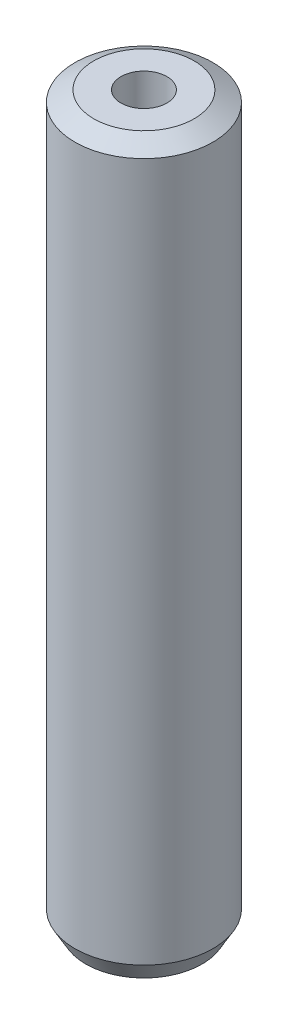
ISO-10303-21;
HEADER;
FILE_DESCRIPTION(('STEP AP214'),'2;1');
FILE_NAME('part.step','',(''),(''),'','','');
FILE_SCHEMA(('AUTOMOTIVE_DESIGN { 1 0 10303 214 1 1 1 1 }'));
ENDSEC;
DATA;
#1=APPLICATION_CONTEXT('core data for automotive mechanical design processes');
#2=APPLICATION_PROTOCOL_DEFINITION('international standard','automotive_design',2000,#1);
#3=PRODUCT_CONTEXT('',#1,'mechanical');
#4=PRODUCT('Part','Part','',(#3));
#5=PRODUCT_RELATED_PRODUCT_CATEGORY('part','',(#4));
#6=PRODUCT_DEFINITION_FORMATION('','',#4);
#7=PRODUCT_DEFINITION_CONTEXT('part definition',#1,'design');
#8=PRODUCT_DEFINITION('design','',#6,#7);
#9=PRODUCT_DEFINITION_SHAPE('','',#8);
#10=(LENGTH_UNIT() NAMED_UNIT(*) SI_UNIT(.MILLI.,.METRE.));
#11=(NAMED_UNIT(*) PLANE_ANGLE_UNIT() SI_UNIT($,.RADIAN.));
#12=(NAMED_UNIT(*) SI_UNIT($,.STERADIAN.) SOLID_ANGLE_UNIT());
#13=UNCERTAINTY_MEASURE_WITH_UNIT(LENGTH_MEASURE(1.E-05),#10,'distance_accuracy_value','');
#14=(GEOMETRIC_REPRESENTATION_CONTEXT(3) GLOBAL_UNCERTAINTY_ASSIGNED_CONTEXT((#13)) GLOBAL_UNIT_ASSIGNED_CONTEXT((#10,
#11,#12)) REPRESENTATION_CONTEXT('',''));
#15=CARTESIAN_POINT('',(0.,0.,0.));
#16=DIRECTION('',(0.,0.,1.));
#17=DIRECTION('',(1.,0.,0.));
#18=AXIS2_PLACEMENT_3D('',#15,#16,#17);
#19=CARTESIAN_POINT('',(0.,369.29795770147,0.));
#20=DIRECTION('',(0.,-1.,0.));
#21=DIRECTION('',(0.,0.,-1.));
#22=AXIS2_PLACEMENT_3D('',#19,#20,#21);
#23=CYLINDRICAL_SURFACE('',#22,35.);
#24=CARTESIAN_POINT('',(0.,363.794376822904,0.));
#25=DIRECTION('',(0.,1.,0.));
#26=DIRECTION('',(0.,0.,1.));
#27=AXIS2_PLACEMENT_3D('',#24,#25,#26);
#28=CIRCLE('',#27,35.);
#29=CARTESIAN_POINT('',(0.,363.794376822904,35.));
#30=VERTEX_POINT('',#29);
#31=EDGE_CURVE('E50',#30,#30,#28,.F.);
#32=ORIENTED_EDGE('',*,*,#31,.T.);
#33=EDGE_LOOP('',(#32));
#34=FACE_BOUND('',#33,.T.);
#35=CARTESIAN_POINT('',(0.,9.53248170524001,0.));
#36=DIRECTION('',(0.,1.,0.));
#37=DIRECTION('',(0.,0.,1.));
#38=AXIS2_PLACEMENT_3D('',#35,#36,#37);
#39=CIRCLE('',#38,35.);
#40=CARTESIAN_POINT('',(0.,9.53248170524001,35.));
#41=VERTEX_POINT('',#40);
#42=EDGE_CURVE('E51',#41,#41,#39,.T.);
#43=ORIENTED_EDGE('',*,*,#42,.T.);
#44=EDGE_LOOP('',(#43));
#45=FACE_BOUND('',#44,.T.);
#46=ADVANCED_FACE('F39',(#34,#45),#23,.T.);
#47=CARTESIAN_POINT('',(0.,369.29795770147,0.));
#48=DIRECTION('',(0.,1.,0.));
#49=DIRECTION('',(0.,0.,1.));
#50=AXIS2_PLACEMENT_3D('',#47,#48,#49);
#51=PLANE('',#50);
#52=CARTESIAN_POINT('',(0.,369.29795770147,0.));
#53=DIRECTION('',(0.,1.,0.));
#54=DIRECTION('',(0.,0.,1.));
#55=AXIS2_PLACEMENT_3D('',#52,#53,#54);
#56=CIRCLE('',#55,25.4675182947601);
#57=CARTESIAN_POINT('',(0.,369.29795770147,25.4675182947601));
#58=VERTEX_POINT('',#57);
#59=EDGE_CURVE('E54',#58,#58,#56,.T.);
#60=ORIENTED_EDGE('',*,*,#59,.T.);
#61=EDGE_LOOP('',(#60));
#62=FACE_BOUND('',#61,.T.);
#63=CARTESIAN_POINT('',(0.,369.29795770147,0.));
#64=DIRECTION('',(0.,1.,0.));
#65=DIRECTION('',(0.,0.,1.));
#66=AXIS2_PLACEMENT_3D('',#63,#64,#65);
#67=CIRCLE('',#66,11.651275917374);
#68=CARTESIAN_POINT('',(0.,369.29795770147,11.651275917374));
#69=VERTEX_POINT('',#68);
#70=EDGE_CURVE('E58',#69,#69,#67,.T.);
#71=ORIENTED_EDGE('',*,*,#70,.F.);
#72=EDGE_LOOP('',(#71));
#73=FACE_BOUND('',#72,.T.);
#74=ADVANCED_FACE('F69',(#62,#73),#51,.T.);
#75=CARTESIAN_POINT('',(0.,0.,0.));
#76=DIRECTION('',(0.,1.,0.));
#77=DIRECTION('',(0.,0.,1.));
#78=AXIS2_PLACEMENT_3D('',#75,#76,#77);
#79=PLANE('',#78);
#80=CARTESIAN_POINT('',(0.,0.,0.));
#81=DIRECTION('',(0.,1.,0.));
#82=DIRECTION('',(0.,0.,1.));
#83=AXIS2_PLACEMENT_3D('',#80,#81,#82);
#84=CIRCLE('',#83,29.4964191214345);
#85=CARTESIAN_POINT('',(0.,0.,29.4964191214345));
#86=VERTEX_POINT('',#85);
#87=EDGE_CURVE('E10',#86,#86,#84,.F.);
#88=ORIENTED_EDGE('',*,*,#87,.T.);
#89=EDGE_LOOP('',(#88));
#90=FACE_BOUND('',#89,.T.);
#91=CARTESIAN_POINT('',(0.,0.,0.));
#92=DIRECTION('',(0.,1.,0.));
#93=DIRECTION('',(0.,0.,1.));
#94=AXIS2_PLACEMENT_3D('',#91,#92,#93);
#95=CIRCLE('',#94,11.651275917374);
#96=CARTESIAN_POINT('',(0.,0.,11.651275917374));
#97=VERTEX_POINT('',#96);
#98=EDGE_CURVE('E63',#97,#97,#95,.T.);
#99=ORIENTED_EDGE('',*,*,#98,.T.);
#100=EDGE_LOOP('',(#99));
#101=FACE_BOUND('',#100,.T.);
#102=ADVANCED_FACE('F75',(#90,#101),#79,.F.);
#103=CARTESIAN_POINT('',(0.,369.29795770147,0.));
#104=DIRECTION('',(0.,-1.,0.));
#105=DIRECTION('',(0.,0.,-1.));
#106=AXIS2_PLACEMENT_3D('',#103,#104,#105);
#107=CYLINDRICAL_SURFACE('',#106,11.651275917374);
#108=ORIENTED_EDGE('',*,*,#70,.T.);
#109=EDGE_LOOP('',(#108));
#110=FACE_BOUND('',#109,.T.);
#111=ORIENTED_EDGE('',*,*,#98,.F.);
#112=EDGE_LOOP('',(#111));
#113=FACE_BOUND('',#112,.T.);
#114=ADVANCED_FACE('F70',(#110,#113),#107,.F.);
#115=CARTESIAN_POINT('',(0.,369.29795770147,0.));
#116=DIRECTION('',(0.,-1.,0.));
#117=DIRECTION('',(0.,0.,-1.));
#118=AXIS2_PLACEMENT_3D('',#115,#116,#117);
#119=CONICAL_SURFACE('',#118,25.4675182947601,1.04719755119659);
#120=ORIENTED_EDGE('',*,*,#31,.F.);
#121=EDGE_LOOP('',(#120));
#122=FACE_BOUND('',#121,.T.);
#123=ORIENTED_EDGE('',*,*,#59,.F.);
#124=EDGE_LOOP('',(#123));
#125=FACE_BOUND('',#124,.T.);
#126=ADVANCED_FACE('F81',(#122,#125),#119,.T.);
#127=CARTESIAN_POINT('',(0.,9.53248170524001,0.));
#128=DIRECTION('',(0.,1.,0.));
#129=DIRECTION('',(0.,0.,1.));
#130=AXIS2_PLACEMENT_3D('',#127,#128,#129);
#131=CONICAL_SURFACE('',#130,35.,0.523598775598302);
#132=ORIENTED_EDGE('',*,*,#87,.F.);
#133=EDGE_LOOP('',(#132));
#134=FACE_BOUND('',#133,.T.);
#135=ORIENTED_EDGE('',*,*,#42,.F.);
#136=EDGE_LOOP('',(#135));
#137=FACE_BOUND('',#136,.T.);
#138=ADVANCED_FACE('F45',(#134,#137),#131,.T.);
#139=CLOSED_SHELL('',(#46,#74,#102,#114,#126,#138));
#140=MANIFOLD_SOLID_BREP('B2',#139);
#141=ADVANCED_BREP_SHAPE_REPRESENTATION('',(#18,#140),#14);
#142=SHAPE_DEFINITION_REPRESENTATION(#9,#141);
ENDSEC;
END-ISO-10303-21;
